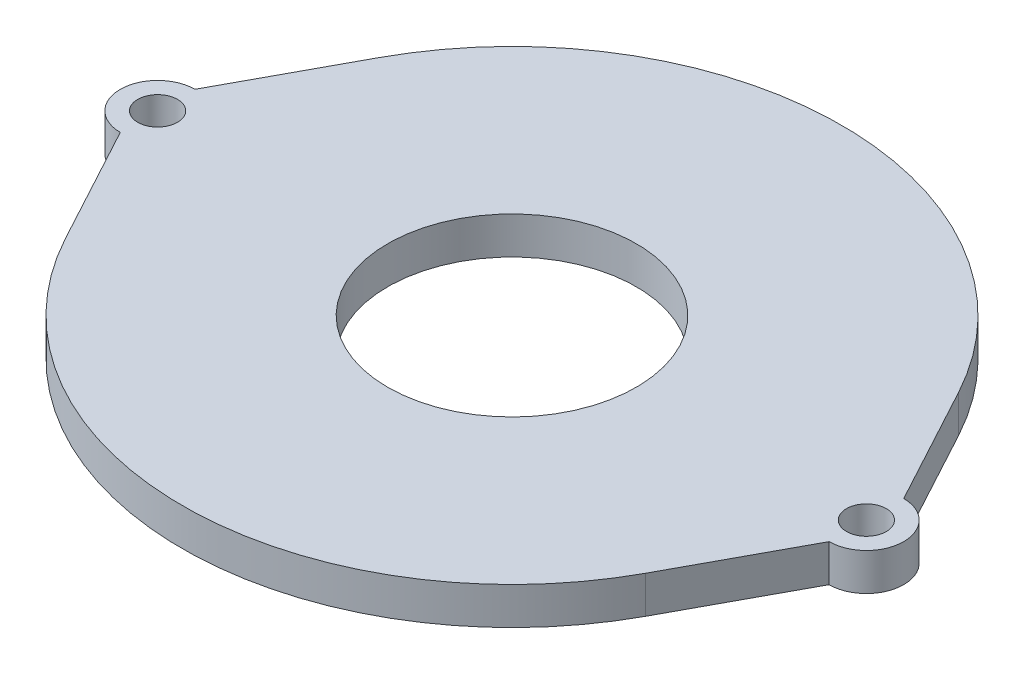
ISO-10303-21;
HEADER;
FILE_DESCRIPTION(('STEP AP214'),'2;1');
FILE_NAME('part.step','',(''),(''),'','','');
FILE_SCHEMA(('AUTOMOTIVE_DESIGN { 1 0 10303 214 1 1 1 1 }'));
ENDSEC;
DATA;
#1=APPLICATION_CONTEXT('core data for automotive mechanical design processes');
#2=APPLICATION_PROTOCOL_DEFINITION('international standard','automotive_design',2000,#1);
#3=PRODUCT_CONTEXT('',#1,'mechanical');
#4=PRODUCT('Part','Part','',(#3));
#5=PRODUCT_RELATED_PRODUCT_CATEGORY('part','',(#4));
#6=PRODUCT_DEFINITION_FORMATION('','',#4);
#7=PRODUCT_DEFINITION_CONTEXT('part definition',#1,'design');
#8=PRODUCT_DEFINITION('design','',#6,#7);
#9=PRODUCT_DEFINITION_SHAPE('','',#8);
#10=(LENGTH_UNIT() NAMED_UNIT(*) SI_UNIT(.MILLI.,.METRE.));
#11=(NAMED_UNIT(*) PLANE_ANGLE_UNIT() SI_UNIT($,.RADIAN.));
#12=(NAMED_UNIT(*) SI_UNIT($,.STERADIAN.) SOLID_ANGLE_UNIT());
#13=UNCERTAINTY_MEASURE_WITH_UNIT(LENGTH_MEASURE(1.E-05),#10,'distance_accuracy_value','');
#14=(GEOMETRIC_REPRESENTATION_CONTEXT(3) GLOBAL_UNCERTAINTY_ASSIGNED_CONTEXT((#13)) GLOBAL_UNIT_ASSIGNED_CONTEXT((#10,
#11,#12)) REPRESENTATION_CONTEXT('',''));
#15=CARTESIAN_POINT('',(0.,0.,0.));
#16=DIRECTION('',(0.,0.,1.));
#17=DIRECTION('',(1.,0.,0.));
#18=AXIS2_PLACEMENT_3D('',#15,#16,#17);
#19=CARTESIAN_POINT('',(-28.5,-3.,0.));
#20=DIRECTION('',(0.,1.,0.));
#21=DIRECTION('',(0.,0.,1.));
#22=AXIS2_PLACEMENT_3D('',#19,#20,#21);
#23=PLANE('',#22);
#24=CARTESIAN_POINT('',(28.5,-3.,0.));
#25=DIRECTION('',(0.,-1.,0.));
#26=DIRECTION('',(0.,0.,-1.));
#27=AXIS2_PLACEMENT_3D('',#24,#25,#26);
#28=CIRCLE('',#27,1.6);
#29=CARTESIAN_POINT('',(28.5,-3.,-1.6));
#30=VERTEX_POINT('',#29);
#31=EDGE_CURVE('E285',#30,#30,#28,.T.);
#32=ORIENTED_EDGE('',*,*,#31,.F.);
#33=EDGE_LOOP('',(#32));
#34=FACE_BOUND('',#33,.T.);
#35=CARTESIAN_POINT('',(0.,-3.,0.));
#36=DIRECTION('',(0.,1.,0.));
#37=DIRECTION('',(0.,0.,1.));
#38=AXIS2_PLACEMENT_3D('',#35,#36,#37);
#39=CIRCLE('',#38,10.);
#40=CARTESIAN_POINT('',(0.,-3.,10.));
#41=VERTEX_POINT('',#40);
#42=EDGE_CURVE('E139',#41,#41,#39,.T.);
#43=ORIENTED_EDGE('',*,*,#42,.T.);
#44=EDGE_LOOP('',(#43));
#45=FACE_BOUND('',#44,.T.);
#46=CARTESIAN_POINT('',(-28.5,-3.,0.));
#47=DIRECTION('',(0.,1.,0.));
#48=DIRECTION('',(0.,0.,1.));
#49=AXIS2_PLACEMENT_3D('',#46,#47,#48);
#50=CIRCLE('',#49,3.);
#51=CARTESIAN_POINT('',(-28.5,-3.,-3.));
#52=VERTEX_POINT('',#51);
#53=CARTESIAN_POINT('',(-28.5,-3.,3.));
#54=VERTEX_POINT('',#53);
#55=EDGE_CURVE('E156',#52,#54,#50,.T.);
#56=ORIENTED_EDGE('',*,*,#55,.F.);
#57=DIRECTION('',(-0.475370831375486,0.,0.879785526521879));
#58=VECTOR('',#57,1.);
#59=CARTESIAN_POINT('',(-28.5,-3.,-3.));
#60=LINE('',#59,#58);
#61=CARTESIAN_POINT('',(-23.3143164528298,-3.,-12.5973270314504));
#62=VERTEX_POINT('',#61);
#63=EDGE_CURVE('E125',#62,#52,#60,.T.);
#64=ORIENTED_EDGE('',*,*,#63,.F.);
#65=CARTESIAN_POINT('',(0.,-3.,0.));
#66=DIRECTION('',(0.,1.,0.));
#67=DIRECTION('',(0.,0.,1.));
#68=AXIS2_PLACEMENT_3D('',#65,#66,#67);
#69=CIRCLE('',#68,26.5);
#70=CARTESIAN_POINT('',(23.3143164528298,-3.,-12.5973270314504));
#71=VERTEX_POINT('',#70);
#72=EDGE_CURVE('E110',#71,#62,#69,.T.);
#73=ORIENTED_EDGE('',*,*,#72,.F.);
#74=DIRECTION('',(-0.475370831375486,0.,-0.879785526521879));
#75=VECTOR('',#74,1.);
#76=CARTESIAN_POINT('',(28.5,-3.,-3.));
#77=LINE('',#76,#75);
#78=CARTESIAN_POINT('',(28.5,-3.,-3.));
#79=VERTEX_POINT('',#78);
#80=EDGE_CURVE('E123',#79,#71,#77,.T.);
#81=ORIENTED_EDGE('',*,*,#80,.F.);
#82=CARTESIAN_POINT('',(28.5,-3.,0.));
#83=DIRECTION('',(0.,1.,0.));
#84=DIRECTION('',(0.,0.,1.));
#85=AXIS2_PLACEMENT_3D('',#82,#83,#84);
#86=CIRCLE('',#85,3.);
#87=CARTESIAN_POINT('',(28.5,-3.,3.));
#88=VERTEX_POINT('',#87);
#89=EDGE_CURVE('E128',#88,#79,#86,.T.);
#90=ORIENTED_EDGE('',*,*,#89,.F.);
#91=DIRECTION('',(0.475370831375486,0.,-0.879785526521879));
#92=VECTOR('',#91,1.);
#93=CARTESIAN_POINT('',(28.5,-3.,3.));
#94=LINE('',#93,#92);
#95=CARTESIAN_POINT('',(23.3143164528298,-3.,12.5973270314504));
#96=VERTEX_POINT('',#95);
#97=EDGE_CURVE('E130',#96,#88,#94,.T.);
#98=ORIENTED_EDGE('',*,*,#97,.F.);
#99=CARTESIAN_POINT('',(0.,-3.,0.));
#100=DIRECTION('',(0.,1.,0.));
#101=DIRECTION('',(0.,0.,1.));
#102=AXIS2_PLACEMENT_3D('',#99,#100,#101);
#103=CIRCLE('',#102,26.5);
#104=CARTESIAN_POINT('',(-23.3143164528298,-3.,12.5973270314504));
#105=VERTEX_POINT('',#104);
#106=EDGE_CURVE('E217',#105,#96,#103,.T.);
#107=ORIENTED_EDGE('',*,*,#106,.F.);
#108=DIRECTION('',(0.475370831375486,0.,0.879785526521879));
#109=VECTOR('',#108,1.);
#110=CARTESIAN_POINT('',(-28.5,-3.,3.));
#111=LINE('',#110,#109);
#112=EDGE_CURVE('E215',#54,#105,#111,.T.);
#113=ORIENTED_EDGE('',*,*,#112,.F.);
#114=EDGE_LOOP('',(#56,#64,#73,#81,#90,#98,#107,#113));
#115=FACE_BOUND('',#114,.T.);
#116=CARTESIAN_POINT('',(-28.5,-3.,0.));
#117=DIRECTION('',(0.,-1.,0.));
#118=DIRECTION('',(0.,0.,-1.));
#119=AXIS2_PLACEMENT_3D('',#116,#117,#118);
#120=CIRCLE('',#119,1.6);
#121=CARTESIAN_POINT('',(-28.5,-3.,-1.6));
#122=VERTEX_POINT('',#121);
#123=EDGE_CURVE('E211',#122,#122,#120,.T.);
#124=ORIENTED_EDGE('',*,*,#123,.F.);
#125=EDGE_LOOP('',(#124));
#126=FACE_BOUND('',#125,.T.);
#127=ADVANCED_FACE('F37',(#34,#45,#115,#126),#23,.F.);
#128=CARTESIAN_POINT('',(-28.5,-3.,0.));
#129=DIRECTION('',(0.,1.,0.));
#130=DIRECTION('',(0.,0.,1.));
#131=AXIS2_PLACEMENT_3D('',#128,#129,#130);
#132=CYLINDRICAL_SURFACE('',#131,3.);
#133=CARTESIAN_POINT('',(-28.5,0.,0.));
#134=DIRECTION('',(0.,1.,0.));
#135=DIRECTION('',(0.,0.,1.));
#136=AXIS2_PLACEMENT_3D('',#133,#134,#135);
#137=CIRCLE('',#136,3.);
#138=CARTESIAN_POINT('',(-28.5,0.,-3.));
#139=VERTEX_POINT('',#138);
#140=CARTESIAN_POINT('',(-28.5,0.,3.));
#141=VERTEX_POINT('',#140);
#142=EDGE_CURVE('E135',#139,#141,#137,.T.);
#143=ORIENTED_EDGE('',*,*,#142,.F.);
#144=DIRECTION('',(0.,1.,0.));
#145=VECTOR('',#144,1.);
#146=CARTESIAN_POINT('',(-28.5,-3.,-3.));
#147=LINE('',#146,#145);
#148=EDGE_CURVE('E11',#52,#139,#147,.T.);
#149=ORIENTED_EDGE('',*,*,#148,.F.);
#150=ORIENTED_EDGE('',*,*,#55,.T.);
#151=DIRECTION('',(0.,1.,0.));
#152=VECTOR('',#151,1.);
#153=CARTESIAN_POINT('',(-28.5,-3.,3.));
#154=LINE('',#153,#152);
#155=EDGE_CURVE('E41',#54,#141,#154,.T.);
#156=ORIENTED_EDGE('',*,*,#155,.T.);
#157=EDGE_LOOP('',(#143,#149,#150,#156));
#158=FACE_BOUND('',#157,.T.);
#159=ADVANCED_FACE('F39',(#158),#132,.T.);
#160=CARTESIAN_POINT('',(-28.5,-3.,-3.));
#161=DIRECTION('',(-0.879785526521879,0.,-0.475370831375486));
#162=DIRECTION('',(-0.475370831375486,0.,0.879785526521879));
#163=AXIS2_PLACEMENT_3D('',#160,#161,#162);
#164=PLANE('',#163);
#165=DIRECTION('',(-0.475370831375486,0.,0.879785526521879));
#166=VECTOR('',#165,1.);
#167=CARTESIAN_POINT('',(-28.5,0.,-3.));
#168=LINE('',#167,#166);
#169=CARTESIAN_POINT('',(-23.3143164528298,0.,-12.5973270314504));
#170=VERTEX_POINT('',#169);
#171=EDGE_CURVE('E154',#170,#139,#168,.T.);
#172=ORIENTED_EDGE('',*,*,#171,.F.);
#173=DIRECTION('',(0.,1.,0.));
#174=VECTOR('',#173,1.);
#175=CARTESIAN_POINT('',(-23.3143164528298,-3.,-12.5973270314504));
#176=LINE('',#175,#174);
#177=EDGE_CURVE('E47',#62,#170,#176,.T.);
#178=ORIENTED_EDGE('',*,*,#177,.F.);
#179=ORIENTED_EDGE('',*,*,#63,.T.);
#180=ORIENTED_EDGE('',*,*,#148,.T.);
#181=EDGE_LOOP('',(#172,#178,#179,#180));
#182=FACE_BOUND('',#181,.T.);
#183=ADVANCED_FACE('F168',(#182),#164,.T.);
#184=CARTESIAN_POINT('',(0.,-3.,0.));
#185=DIRECTION('',(0.,1.,0.));
#186=DIRECTION('',(0.,0.,1.));
#187=AXIS2_PLACEMENT_3D('',#184,#185,#186);
#188=CYLINDRICAL_SURFACE('',#187,26.5);
#189=CARTESIAN_POINT('',(0.,0.,0.));
#190=DIRECTION('',(0.,1.,0.));
#191=DIRECTION('',(0.,0.,1.));
#192=AXIS2_PLACEMENT_3D('',#189,#190,#191);
#193=CIRCLE('',#192,26.5);
#194=CARTESIAN_POINT('',(23.3143164528298,0.,-12.5973270314504));
#195=VERTEX_POINT('',#194);
#196=EDGE_CURVE('E112',#195,#170,#193,.T.);
#197=ORIENTED_EDGE('',*,*,#196,.F.);
#198=DIRECTION('',(0.,1.,0.));
#199=VECTOR('',#198,1.);
#200=CARTESIAN_POINT('',(23.3143164528298,-3.,-12.5973270314504));
#201=LINE('',#200,#199);
#202=EDGE_CURVE('E107',#71,#195,#201,.T.);
#203=ORIENTED_EDGE('',*,*,#202,.F.);
#204=ORIENTED_EDGE('',*,*,#72,.T.);
#205=ORIENTED_EDGE('',*,*,#177,.T.);
#206=EDGE_LOOP('',(#197,#203,#204,#205));
#207=FACE_BOUND('',#206,.T.);
#208=ADVANCED_FACE('F109',(#207),#188,.T.);
#209=CARTESIAN_POINT('',(28.5,-3.,-3.));
#210=DIRECTION('',(0.879785526521879,0.,-0.475370831375486));
#211=DIRECTION('',(-0.475370831375486,0.,-0.879785526521879));
#212=AXIS2_PLACEMENT_3D('',#209,#210,#211);
#213=PLANE('',#212);
#214=DIRECTION('',(-0.475370831375486,0.,-0.879785526521879));
#215=VECTOR('',#214,1.);
#216=CARTESIAN_POINT('',(28.5,0.,-3.));
#217=LINE('',#216,#215);
#218=CARTESIAN_POINT('',(28.5,0.,-3.));
#219=VERTEX_POINT('',#218);
#220=EDGE_CURVE('E151',#219,#195,#217,.T.);
#221=ORIENTED_EDGE('',*,*,#220,.F.);
#222=DIRECTION('',(0.,1.,0.));
#223=VECTOR('',#222,1.);
#224=CARTESIAN_POINT('',(28.5,-3.,-3.));
#225=LINE('',#224,#223);
#226=EDGE_CURVE('E117',#79,#219,#225,.T.);
#227=ORIENTED_EDGE('',*,*,#226,.F.);
#228=ORIENTED_EDGE('',*,*,#80,.T.);
#229=ORIENTED_EDGE('',*,*,#202,.T.);
#230=EDGE_LOOP('',(#221,#227,#228,#229));
#231=FACE_BOUND('',#230,.T.);
#232=ADVANCED_FACE('F127',(#231),#213,.T.);
#233=CARTESIAN_POINT('',(28.5,-3.,0.));
#234=DIRECTION('',(0.,1.,0.));
#235=DIRECTION('',(0.,0.,1.));
#236=AXIS2_PLACEMENT_3D('',#233,#234,#235);
#237=CYLINDRICAL_SURFACE('',#236,3.);
#238=CARTESIAN_POINT('',(28.5,0.,0.));
#239=DIRECTION('',(0.,1.,0.));
#240=DIRECTION('',(0.,0.,1.));
#241=AXIS2_PLACEMENT_3D('',#238,#239,#240);
#242=CIRCLE('',#241,3.);
#243=CARTESIAN_POINT('',(28.5,0.,3.));
#244=VERTEX_POINT('',#243);
#245=EDGE_CURVE('E148',#244,#219,#242,.T.);
#246=ORIENTED_EDGE('',*,*,#245,.F.);
#247=DIRECTION('',(0.,1.,0.));
#248=VECTOR('',#247,1.);
#249=CARTESIAN_POINT('',(28.5,-3.,3.));
#250=LINE('',#249,#248);
#251=EDGE_CURVE('E160',#88,#244,#250,.T.);
#252=ORIENTED_EDGE('',*,*,#251,.F.);
#253=ORIENTED_EDGE('',*,*,#89,.T.);
#254=ORIENTED_EDGE('',*,*,#226,.T.);
#255=EDGE_LOOP('',(#246,#252,#253,#254));
#256=FACE_BOUND('',#255,.T.);
#257=ADVANCED_FACE('F228',(#256),#237,.T.);
#258=CARTESIAN_POINT('',(28.5,-3.,3.));
#259=DIRECTION('',(0.879785526521879,0.,0.475370831375486));
#260=DIRECTION('',(0.475370831375486,0.,-0.879785526521879));
#261=AXIS2_PLACEMENT_3D('',#258,#259,#260);
#262=PLANE('',#261);
#263=DIRECTION('',(0.475370831375486,0.,-0.879785526521879));
#264=VECTOR('',#263,1.);
#265=CARTESIAN_POINT('',(28.5,0.,3.));
#266=LINE('',#265,#264);
#267=CARTESIAN_POINT('',(23.3143164528298,0.,12.5973270314504));
#268=VERTEX_POINT('',#267);
#269=EDGE_CURVE('E145',#268,#244,#266,.T.);
#270=ORIENTED_EDGE('',*,*,#269,.F.);
#271=DIRECTION('',(0.,1.,0.));
#272=VECTOR('',#271,1.);
#273=CARTESIAN_POINT('',(23.3143164528298,-3.,12.5973270314504));
#274=LINE('',#273,#272);
#275=EDGE_CURVE('E162',#96,#268,#274,.T.);
#276=ORIENTED_EDGE('',*,*,#275,.F.);
#277=ORIENTED_EDGE('',*,*,#97,.T.);
#278=ORIENTED_EDGE('',*,*,#251,.T.);
#279=EDGE_LOOP('',(#270,#276,#277,#278));
#280=FACE_BOUND('',#279,.T.);
#281=ADVANCED_FACE('F223',(#280),#262,.T.);
#282=CARTESIAN_POINT('',(0.,-3.,0.));
#283=DIRECTION('',(0.,1.,0.));
#284=DIRECTION('',(0.,0.,1.));
#285=AXIS2_PLACEMENT_3D('',#282,#283,#284);
#286=CYLINDRICAL_SURFACE('',#285,26.5);
#287=CARTESIAN_POINT('',(0.,0.,0.));
#288=DIRECTION('',(0.,1.,0.));
#289=DIRECTION('',(0.,0.,1.));
#290=AXIS2_PLACEMENT_3D('',#287,#288,#289);
#291=CIRCLE('',#290,26.5);
#292=CARTESIAN_POINT('',(-23.3143164528298,0.,12.5973270314504));
#293=VERTEX_POINT('',#292);
#294=EDGE_CURVE('E142',#293,#268,#291,.T.);
#295=ORIENTED_EDGE('',*,*,#294,.F.);
#296=DIRECTION('',(0.,1.,0.));
#297=VECTOR('',#296,1.);
#298=CARTESIAN_POINT('',(-23.3143164528298,-3.,12.5973270314504));
#299=LINE('',#298,#297);
#300=EDGE_CURVE('E163',#105,#293,#299,.T.);
#301=ORIENTED_EDGE('',*,*,#300,.F.);
#302=ORIENTED_EDGE('',*,*,#106,.T.);
#303=ORIENTED_EDGE('',*,*,#275,.T.);
#304=EDGE_LOOP('',(#295,#301,#302,#303));
#305=FACE_BOUND('',#304,.T.);
#306=ADVANCED_FACE('F195',(#305),#286,.T.);
#307=CARTESIAN_POINT('',(-28.5,-3.,3.));
#308=DIRECTION('',(-0.879785526521879,0.,0.475370831375486));
#309=DIRECTION('',(0.475370831375486,0.,0.879785526521879));
#310=AXIS2_PLACEMENT_3D('',#307,#308,#309);
#311=PLANE('',#310);
#312=DIRECTION('',(0.475370831375486,0.,0.879785526521879));
#313=VECTOR('',#312,1.);
#314=CARTESIAN_POINT('',(-28.5,0.,3.));
#315=LINE('',#314,#313);
#316=EDGE_CURVE('E138',#141,#293,#315,.T.);
#317=ORIENTED_EDGE('',*,*,#316,.F.);
#318=ORIENTED_EDGE('',*,*,#155,.F.);
#319=ORIENTED_EDGE('',*,*,#112,.T.);
#320=ORIENTED_EDGE('',*,*,#300,.T.);
#321=EDGE_LOOP('',(#317,#318,#319,#320));
#322=FACE_BOUND('',#321,.T.);
#323=ADVANCED_FACE('F165',(#322),#311,.T.);
#324=CARTESIAN_POINT('',(-28.5,0.,0.));
#325=DIRECTION('',(0.,1.,0.));
#326=DIRECTION('',(0.,0.,1.));
#327=AXIS2_PLACEMENT_3D('',#324,#325,#326);
#328=PLANE('',#327);
#329=CARTESIAN_POINT('',(28.5,0.,0.));
#330=DIRECTION('',(0.,1.,0.));
#331=DIRECTION('',(0.,0.,1.));
#332=AXIS2_PLACEMENT_3D('',#329,#330,#331);
#333=CIRCLE('',#332,1.6);
#334=CARTESIAN_POINT('',(28.5,0.,1.6));
#335=VERTEX_POINT('',#334);
#336=EDGE_CURVE('E199',#335,#335,#333,.T.);
#337=ORIENTED_EDGE('',*,*,#336,.F.);
#338=EDGE_LOOP('',(#337));
#339=FACE_BOUND('',#338,.T.);
#340=CARTESIAN_POINT('',(-28.5,0.,0.));
#341=DIRECTION('',(0.,1.,0.));
#342=DIRECTION('',(0.,0.,1.));
#343=AXIS2_PLACEMENT_3D('',#340,#341,#342);
#344=CIRCLE('',#343,1.6);
#345=CARTESIAN_POINT('',(-28.5,0.,1.6));
#346=VERTEX_POINT('',#345);
#347=EDGE_CURVE('E203',#346,#346,#344,.T.);
#348=ORIENTED_EDGE('',*,*,#347,.F.);
#349=EDGE_LOOP('',(#348));
#350=FACE_BOUND('',#349,.T.);
#351=CARTESIAN_POINT('',(0.,0.,0.));
#352=DIRECTION('',(0.,1.,0.));
#353=DIRECTION('',(0.,0.,1.));
#354=AXIS2_PLACEMENT_3D('',#351,#352,#353);
#355=CIRCLE('',#354,10.);
#356=CARTESIAN_POINT('',(0.,0.,10.));
#357=VERTEX_POINT('',#356);
#358=EDGE_CURVE('E206',#357,#357,#355,.T.);
#359=ORIENTED_EDGE('',*,*,#358,.F.);
#360=EDGE_LOOP('',(#359));
#361=FACE_BOUND('',#360,.T.);
#362=ORIENTED_EDGE('',*,*,#142,.T.);
#363=ORIENTED_EDGE('',*,*,#316,.T.);
#364=ORIENTED_EDGE('',*,*,#294,.T.);
#365=ORIENTED_EDGE('',*,*,#269,.T.);
#366=ORIENTED_EDGE('',*,*,#245,.T.);
#367=ORIENTED_EDGE('',*,*,#220,.T.);
#368=ORIENTED_EDGE('',*,*,#196,.T.);
#369=ORIENTED_EDGE('',*,*,#171,.T.);
#370=EDGE_LOOP('',(#362,#363,#364,#365,#366,#367,#368,#369));
#371=FACE_BOUND('',#370,.T.);
#372=ADVANCED_FACE('F167',(#339,#350,#361,#371),#328,.T.);
#373=CARTESIAN_POINT('',(0.,-3.,0.));
#374=DIRECTION('',(0.,1.,0.));
#375=DIRECTION('',(0.,0.,1.));
#376=AXIS2_PLACEMENT_3D('',#373,#374,#375);
#377=CYLINDRICAL_SURFACE('',#376,10.);
#378=ORIENTED_EDGE('',*,*,#42,.F.);
#379=EDGE_LOOP('',(#378));
#380=FACE_BOUND('',#379,.T.);
#381=ORIENTED_EDGE('',*,*,#358,.T.);
#382=EDGE_LOOP('',(#381));
#383=FACE_BOUND('',#382,.T.);
#384=ADVANCED_FACE('F185',(#380,#383),#377,.F.);
#385=CARTESIAN_POINT('',(-28.5,-3.,0.));
#386=DIRECTION('',(0.,-1.,0.));
#387=DIRECTION('',(0.,0.,-1.));
#388=AXIS2_PLACEMENT_3D('',#385,#386,#387);
#389=CYLINDRICAL_SURFACE('',#388,1.6);
#390=ORIENTED_EDGE('',*,*,#123,.T.);
#391=EDGE_LOOP('',(#390));
#392=FACE_BOUND('',#391,.T.);
#393=ORIENTED_EDGE('',*,*,#347,.T.);
#394=EDGE_LOOP('',(#393));
#395=FACE_BOUND('',#394,.T.);
#396=ADVANCED_FACE('F193',(#392,#395),#389,.F.);
#397=CARTESIAN_POINT('',(28.5,-3.,0.));
#398=DIRECTION('',(0.,-1.,0.));
#399=DIRECTION('',(0.,0.,-1.));
#400=AXIS2_PLACEMENT_3D('',#397,#398,#399);
#401=CYLINDRICAL_SURFACE('',#400,1.6);
#402=ORIENTED_EDGE('',*,*,#31,.T.);
#403=EDGE_LOOP('',(#402));
#404=FACE_BOUND('',#403,.T.);
#405=ORIENTED_EDGE('',*,*,#336,.T.);
#406=EDGE_LOOP('',(#405));
#407=FACE_BOUND('',#406,.T.);
#408=ADVANCED_FACE('F270',(#404,#407),#401,.F.);
#409=CLOSED_SHELL('',(#127,#159,#183,#208,#232,#257,#281,#306,#323,#372,#384,#396,#408));
#410=MANIFOLD_SOLID_BREP('B2',#409);
#411=ADVANCED_BREP_SHAPE_REPRESENTATION('',(#18,#410),#14);
#412=SHAPE_DEFINITION_REPRESENTATION(#9,#411);
ENDSEC;
END-ISO-10303-21;
